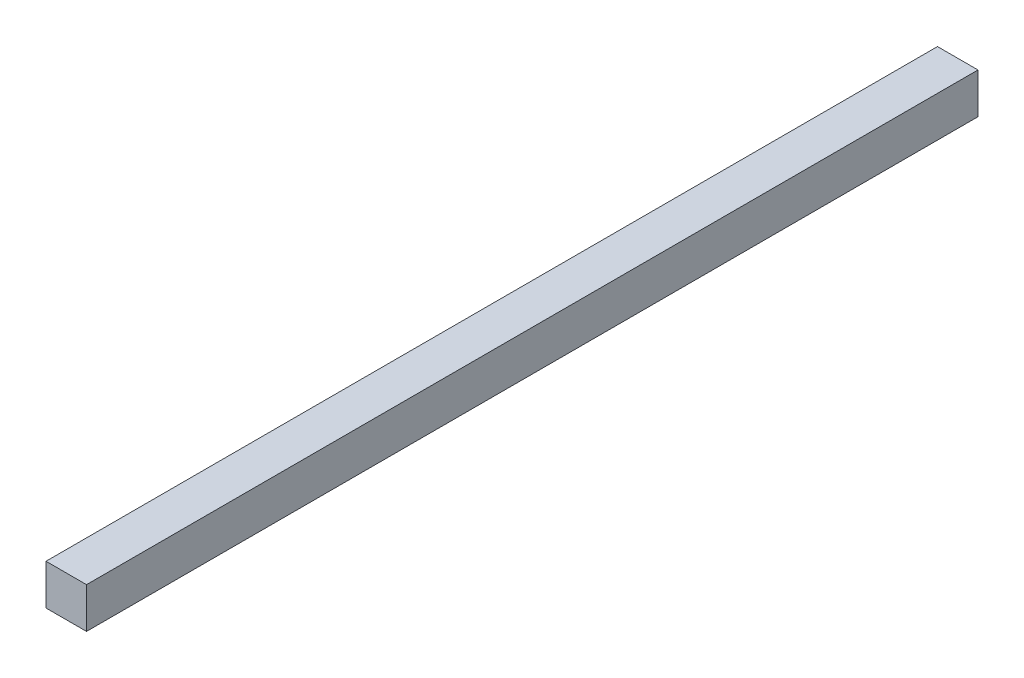
ISO-10303-21;
HEADER;
FILE_DESCRIPTION(('STEP AP214'),'2;1');
FILE_NAME('part.step','',(''),(''),'','','');
FILE_SCHEMA(('AUTOMOTIVE_DESIGN { 1 0 10303 214 1 1 1 1 }'));
ENDSEC;
DATA;
#1=APPLICATION_CONTEXT('core data for automotive mechanical design processes');
#2=APPLICATION_PROTOCOL_DEFINITION('international standard','automotive_design',2000,#1);
#3=PRODUCT_CONTEXT('',#1,'mechanical');
#4=PRODUCT('Part','Part','',(#3));
#5=PRODUCT_RELATED_PRODUCT_CATEGORY('part','',(#4));
#6=PRODUCT_DEFINITION_FORMATION('','',#4);
#7=PRODUCT_DEFINITION_CONTEXT('part definition',#1,'design');
#8=PRODUCT_DEFINITION('design','',#6,#7);
#9=PRODUCT_DEFINITION_SHAPE('','',#8);
#10=(LENGTH_UNIT() NAMED_UNIT(*) SI_UNIT(.MILLI.,.METRE.));
#11=(NAMED_UNIT(*) PLANE_ANGLE_UNIT() SI_UNIT($,.RADIAN.));
#12=(NAMED_UNIT(*) SI_UNIT($,.STERADIAN.) SOLID_ANGLE_UNIT());
#13=UNCERTAINTY_MEASURE_WITH_UNIT(LENGTH_MEASURE(1.E-05),#10,'distance_accuracy_value','');
#14=(GEOMETRIC_REPRESENTATION_CONTEXT(3) GLOBAL_UNCERTAINTY_ASSIGNED_CONTEXT((#13)) GLOBAL_UNIT_ASSIGNED_CONTEXT((#10,
#11,#12)) REPRESENTATION_CONTEXT('',''));
#15=CARTESIAN_POINT('',(0.,0.,0.));
#16=DIRECTION('',(0.,0.,1.));
#17=DIRECTION('',(1.,0.,0.));
#18=AXIS2_PLACEMENT_3D('',#15,#16,#17);
#19=CARTESIAN_POINT('',(12.7,-12.7,558.8));
#20=DIRECTION('',(-1.,0.,0.));
#21=DIRECTION('',(0.,0.,1.));
#22=AXIS2_PLACEMENT_3D('',#19,#20,#21);
#23=PLANE('',#22);
#24=DIRECTION('',(0.,1.,0.));
#25=VECTOR('',#24,1.);
#26=CARTESIAN_POINT('',(12.7,-12.7,0.));
#27=LINE('',#26,#25);
#28=CARTESIAN_POINT('',(12.7,-12.7,0.));
#29=VERTEX_POINT('',#28);
#30=CARTESIAN_POINT('',(12.7,12.7,0.));
#31=VERTEX_POINT('',#30);
#32=EDGE_CURVE('E96',#29,#31,#27,.T.);
#33=ORIENTED_EDGE('',*,*,#32,.T.);
#34=DIRECTION('',(0.,0.,-1.));
#35=VECTOR('',#34,1.);
#36=CARTESIAN_POINT('',(12.7,12.7,558.8));
#37=LINE('',#36,#35);
#38=CARTESIAN_POINT('',(12.7,12.7,558.8));
#39=VERTEX_POINT('',#38);
#40=EDGE_CURVE('E11',#39,#31,#37,.T.);
#41=ORIENTED_EDGE('',*,*,#40,.F.);
#42=DIRECTION('',(0.,1.,0.));
#43=VECTOR('',#42,1.);
#44=CARTESIAN_POINT('',(12.7,-12.7,558.8));
#45=LINE('',#44,#43);
#46=CARTESIAN_POINT('',(12.7,-12.7,558.8));
#47=VERTEX_POINT('',#46);
#48=EDGE_CURVE('E84',#47,#39,#45,.T.);
#49=ORIENTED_EDGE('',*,*,#48,.F.);
#50=DIRECTION('',(0.,0.,-1.));
#51=VECTOR('',#50,1.);
#52=CARTESIAN_POINT('',(12.7,-12.7,558.8));
#53=LINE('',#52,#51);
#54=EDGE_CURVE('E92',#47,#29,#53,.T.);
#55=ORIENTED_EDGE('',*,*,#54,.T.);
#56=EDGE_LOOP('',(#33,#41,#49,#55));
#57=FACE_BOUND('',#56,.T.);
#58=ADVANCED_FACE('F33',(#57),#23,.F.);
#59=CARTESIAN_POINT('',(-12.7,12.7,558.8));
#60=DIRECTION('',(0.,-1.,0.));
#61=DIRECTION('',(0.,0.,-1.));
#62=AXIS2_PLACEMENT_3D('',#59,#60,#61);
#63=PLANE('',#62);
#64=DIRECTION('',(-1.,0.,0.));
#65=VECTOR('',#64,1.);
#66=CARTESIAN_POINT('',(-12.7,12.7,0.));
#67=LINE('',#66,#65);
#68=CARTESIAN_POINT('',(-12.7,12.7,0.));
#69=VERTEX_POINT('',#68);
#70=EDGE_CURVE('E88',#31,#69,#67,.T.);
#71=ORIENTED_EDGE('',*,*,#70,.T.);
#72=DIRECTION('',(0.,0.,-1.));
#73=VECTOR('',#72,1.);
#74=CARTESIAN_POINT('',(-12.7,12.7,558.8));
#75=LINE('',#74,#73);
#76=CARTESIAN_POINT('',(-12.7,12.7,558.8));
#77=VERTEX_POINT('',#76);
#78=EDGE_CURVE('E41',#77,#69,#75,.T.);
#79=ORIENTED_EDGE('',*,*,#78,.F.);
#80=DIRECTION('',(-1.,0.,0.));
#81=VECTOR('',#80,1.);
#82=CARTESIAN_POINT('',(-12.7,12.7,558.8));
#83=LINE('',#82,#81);
#84=EDGE_CURVE('E79',#39,#77,#83,.T.);
#85=ORIENTED_EDGE('',*,*,#84,.F.);
#86=ORIENTED_EDGE('',*,*,#40,.T.);
#87=EDGE_LOOP('',(#71,#79,#85,#86));
#88=FACE_BOUND('',#87,.T.);
#89=ADVANCED_FACE('F87',(#88),#63,.F.);
#90=CARTESIAN_POINT('',(-12.7,-12.7,558.8));
#91=DIRECTION('',(1.,0.,0.));
#92=DIRECTION('',(0.,0.,-1.));
#93=AXIS2_PLACEMENT_3D('',#90,#91,#92);
#94=PLANE('',#93);
#95=DIRECTION('',(0.,-1.,0.));
#96=VECTOR('',#95,1.);
#97=CARTESIAN_POINT('',(-12.7,-12.7,0.));
#98=LINE('',#97,#96);
#99=CARTESIAN_POINT('',(-12.7,-12.7,0.));
#100=VERTEX_POINT('',#99);
#101=EDGE_CURVE('E66',#69,#100,#98,.T.);
#102=ORIENTED_EDGE('',*,*,#101,.T.);
#103=DIRECTION('',(0.,0.,-1.));
#104=VECTOR('',#103,1.);
#105=CARTESIAN_POINT('',(-12.7,-12.7,558.8));
#106=LINE('',#105,#104);
#107=CARTESIAN_POINT('',(-12.7,-12.7,558.8));
#108=VERTEX_POINT('',#107);
#109=EDGE_CURVE('E89',#108,#100,#106,.T.);
#110=ORIENTED_EDGE('',*,*,#109,.F.);
#111=DIRECTION('',(0.,-1.,0.));
#112=VECTOR('',#111,1.);
#113=CARTESIAN_POINT('',(-12.7,-12.7,558.8));
#114=LINE('',#113,#112);
#115=EDGE_CURVE('E82',#77,#108,#114,.T.);
#116=ORIENTED_EDGE('',*,*,#115,.F.);
#117=ORIENTED_EDGE('',*,*,#78,.T.);
#118=EDGE_LOOP('',(#102,#110,#116,#117));
#119=FACE_BOUND('',#118,.T.);
#120=ADVANCED_FACE('F90',(#119),#94,.F.);
#121=CARTESIAN_POINT('',(-12.7,-12.7,558.8));
#122=DIRECTION('',(0.,1.,0.));
#123=DIRECTION('',(0.,0.,1.));
#124=AXIS2_PLACEMENT_3D('',#121,#122,#123);
#125=PLANE('',#124);
#126=DIRECTION('',(1.,0.,0.));
#127=VECTOR('',#126,1.);
#128=CARTESIAN_POINT('',(-12.7,-12.7,0.));
#129=LINE('',#128,#127);
#130=EDGE_CURVE('E72',#100,#29,#129,.T.);
#131=ORIENTED_EDGE('',*,*,#130,.T.);
#132=ORIENTED_EDGE('',*,*,#54,.F.);
#133=DIRECTION('',(1.,0.,0.));
#134=VECTOR('',#133,1.);
#135=CARTESIAN_POINT('',(-12.7,-12.7,558.8));
#136=LINE('',#135,#134);
#137=EDGE_CURVE('E49',#108,#47,#136,.T.);
#138=ORIENTED_EDGE('',*,*,#137,.F.);
#139=ORIENTED_EDGE('',*,*,#109,.T.);
#140=EDGE_LOOP('',(#131,#132,#138,#139));
#141=FACE_BOUND('',#140,.T.);
#142=ADVANCED_FACE('F103',(#141),#125,.F.);
#143=CARTESIAN_POINT('',(0.,0.,558.8));
#144=DIRECTION('',(0.,0.,-1.));
#145=DIRECTION('',(-1.,0.,0.));
#146=AXIS2_PLACEMENT_3D('',#143,#144,#145);
#147=PLANE('',#146);
#148=ORIENTED_EDGE('',*,*,#48,.T.);
#149=ORIENTED_EDGE('',*,*,#84,.T.);
#150=ORIENTED_EDGE('',*,*,#115,.T.);
#151=ORIENTED_EDGE('',*,*,#137,.T.);
#152=EDGE_LOOP('',(#148,#149,#150,#151));
#153=FACE_BOUND('',#152,.T.);
#154=ADVANCED_FACE('F80',(#153),#147,.F.);
#155=CARTESIAN_POINT('',(0.,0.,0.));
#156=DIRECTION('',(0.,0.,-1.));
#157=DIRECTION('',(-1.,0.,0.));
#158=AXIS2_PLACEMENT_3D('',#155,#156,#157);
#159=PLANE('',#158);
#160=ORIENTED_EDGE('',*,*,#32,.F.);
#161=ORIENTED_EDGE('',*,*,#130,.F.);
#162=ORIENTED_EDGE('',*,*,#101,.F.);
#163=ORIENTED_EDGE('',*,*,#70,.F.);
#164=EDGE_LOOP('',(#160,#161,#162,#163));
#165=FACE_BOUND('',#164,.T.);
#166=ADVANCED_FACE('F106',(#165),#159,.T.);
#167=CLOSED_SHELL('',(#58,#89,#120,#142,#154,#166));
#168=MANIFOLD_SOLID_BREP('B2',#167);
#169=ADVANCED_BREP_SHAPE_REPRESENTATION('',(#18,#168),#14);
#170=SHAPE_DEFINITION_REPRESENTATION(#9,#169);
ENDSEC;
END-ISO-10303-21;
